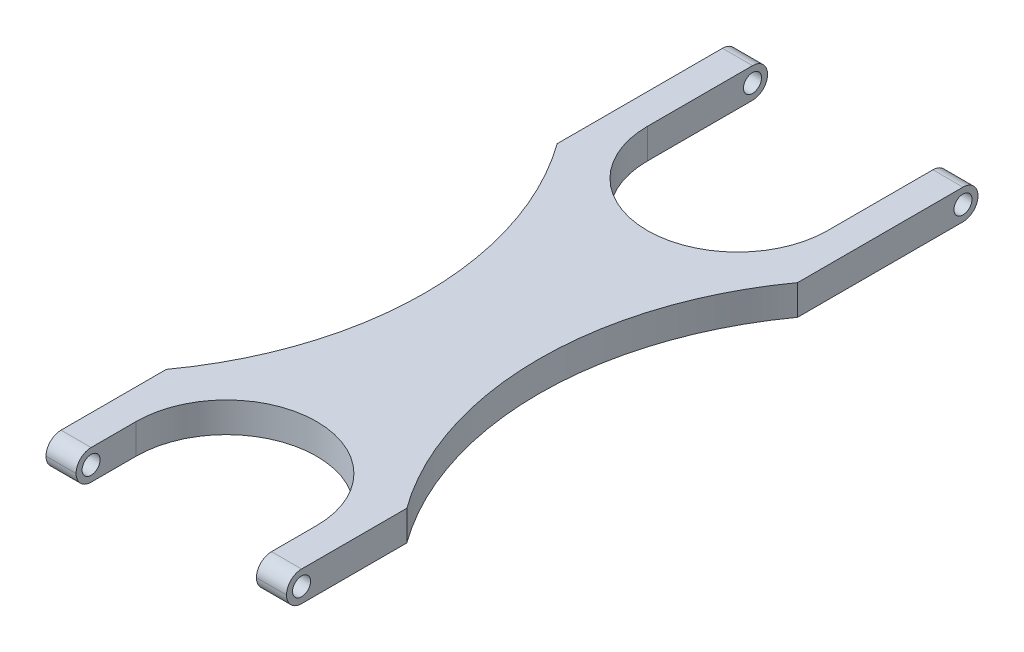
ISO-10303-21;
HEADER;
FILE_DESCRIPTION(('STEP AP214'),'2;1');
FILE_NAME('part.step','',(''),(''),'','','');
FILE_SCHEMA(('AUTOMOTIVE_DESIGN { 1 0 10303 214 1 1 1 1 }'));
ENDSEC;
DATA;
#1=APPLICATION_CONTEXT('core data for automotive mechanical design processes');
#2=APPLICATION_PROTOCOL_DEFINITION('international standard','automotive_design',2000,#1);
#3=PRODUCT_CONTEXT('',#1,'mechanical');
#4=PRODUCT('Part','Part','',(#3));
#5=PRODUCT_RELATED_PRODUCT_CATEGORY('part','',(#4));
#6=PRODUCT_DEFINITION_FORMATION('','',#4);
#7=PRODUCT_DEFINITION_CONTEXT('part definition',#1,'design');
#8=PRODUCT_DEFINITION('design','',#6,#7);
#9=PRODUCT_DEFINITION_SHAPE('','',#8);
#10=(LENGTH_UNIT() NAMED_UNIT(*) SI_UNIT(.MILLI.,.METRE.));
#11=(NAMED_UNIT(*) PLANE_ANGLE_UNIT() SI_UNIT($,.RADIAN.));
#12=(NAMED_UNIT(*) SI_UNIT($,.STERADIAN.) SOLID_ANGLE_UNIT());
#13=UNCERTAINTY_MEASURE_WITH_UNIT(LENGTH_MEASURE(1.E-05),#10,'distance_accuracy_value','');
#14=(GEOMETRIC_REPRESENTATION_CONTEXT(3) GLOBAL_UNCERTAINTY_ASSIGNED_CONTEXT((#13)) GLOBAL_UNIT_ASSIGNED_CONTEXT((#10,
#11,#12)) REPRESENTATION_CONTEXT('',''));
#15=CARTESIAN_POINT('',(0.,0.,0.));
#16=DIRECTION('',(0.,0.,1.));
#17=DIRECTION('',(1.,0.,0.));
#18=AXIS2_PLACEMENT_3D('',#15,#16,#17);
#19=CARTESIAN_POINT('',(0.,12.7,0.));
#20=DIRECTION('',(1.,0.,0.));
#21=DIRECTION('',(0.,0.,-1.));
#22=AXIS2_PLACEMENT_3D('',#19,#20,#21);
#23=PLANE('',#22);
#24=CARTESIAN_POINT('',(-1.11022302462516E-13,6.35,6.35000000000002));
#25=DIRECTION('',(1.,0.,0.));
#26=DIRECTION('',(0.,0.,-1.));
#27=AXIS2_PLACEMENT_3D('',#24,#25,#26);
#28=CIRCLE('',#27,3.81);
#29=CARTESIAN_POINT('',(-1.12410081243297E-13,6.35,2.54000000000002));
#30=VERTEX_POINT('',#29);
#31=EDGE_CURVE('E643',#30,#30,#28,.T.);
#32=ORIENTED_EDGE('',*,*,#31,.T.);
#33=EDGE_LOOP('',(#32));
#34=FACE_BOUND('',#33,.T.);
#35=CARTESIAN_POINT('',(0.,6.35,6.34999999999999));
#36=DIRECTION('',(1.,0.,0.));
#37=DIRECTION('',(0.,0.,-1.));
#38=AXIS2_PLACEMENT_3D('',#35,#36,#37);
#39=CIRCLE('',#38,6.35);
#40=CARTESIAN_POINT('',(0.,12.7,6.34999999999999));
#41=VERTEX_POINT('',#40);
#42=CARTESIAN_POINT('',(0.,6.35,0.));
#43=VERTEX_POINT('',#42);
#44=EDGE_CURVE('E221',#41,#43,#39,.F.);
#45=ORIENTED_EDGE('',*,*,#44,.T.);
#46=CARTESIAN_POINT('',(0.,6.35,6.35));
#47=DIRECTION('',(1.,0.,0.));
#48=DIRECTION('',(0.,0.,-1.));
#49=AXIS2_PLACEMENT_3D('',#46,#47,#48);
#50=CIRCLE('',#49,6.35);
#51=CARTESIAN_POINT('',(0.,0.,6.35));
#52=VERTEX_POINT('',#51);
#53=EDGE_CURVE('E223',#43,#52,#50,.F.);
#54=ORIENTED_EDGE('',*,*,#53,.T.);
#55=DIRECTION('',(0.,0.,1.));
#56=VECTOR('',#55,1.);
#57=CARTESIAN_POINT('',(0.,0.,0.));
#58=LINE('',#57,#56);
#59=CARTESIAN_POINT('',(0.,0.,76.2));
#60=VERTEX_POINT('',#59);
#61=EDGE_CURVE('E194',#52,#60,#58,.T.);
#62=ORIENTED_EDGE('',*,*,#61,.T.);
#63=DIRECTION('',(0.,-1.,0.));
#64=VECTOR('',#63,1.);
#65=CARTESIAN_POINT('',(0.,12.7,76.2));
#66=LINE('',#65,#64);
#67=CARTESIAN_POINT('',(0.,12.7,76.2));
#68=VERTEX_POINT('',#67);
#69=EDGE_CURVE('E187',#68,#60,#66,.T.);
#70=ORIENTED_EDGE('',*,*,#69,.F.);
#71=DIRECTION('',(0.,0.,1.));
#72=VECTOR('',#71,1.);
#73=CARTESIAN_POINT('',(0.,12.7,0.));
#74=LINE('',#73,#72);
#75=EDGE_CURVE('E169',#41,#68,#74,.T.);
#76=ORIENTED_EDGE('',*,*,#75,.F.);
#77=EDGE_LOOP('',(#45,#54,#62,#70,#76));
#78=FACE_BOUND('',#77,.T.);
#79=ADVANCED_FACE('F32',(#34,#78),#23,.F.);
#80=CARTESIAN_POINT('',(-114.3,12.7,158.75));
#81=DIRECTION('',(0.,-1.,0.));
#82=DIRECTION('',(0.,0.,-1.));
#83=AXIS2_PLACEMENT_3D('',#80,#81,#82);
#84=CYLINDRICAL_SURFACE('',#83,140.992881025958);
#85=CARTESIAN_POINT('',(-114.3,0.,158.75));
#86=DIRECTION('',(0.,-1.,0.));
#87=DIRECTION('',(0.,0.,-1.));
#88=AXIS2_PLACEMENT_3D('',#85,#86,#87);
#89=CIRCLE('',#88,140.992881025958);
#90=CARTESIAN_POINT('',(0.,0.,241.3));
#91=VERTEX_POINT('',#90);
#92=EDGE_CURVE('E293',#60,#91,#89,.T.);
#93=ORIENTED_EDGE('',*,*,#92,.T.);
#94=DIRECTION('',(0.,-1.,0.));
#95=VECTOR('',#94,1.);
#96=CARTESIAN_POINT('',(0.,12.7,241.3));
#97=LINE('',#96,#95);
#98=CARTESIAN_POINT('',(0.,12.7,241.3));
#99=VERTEX_POINT('',#98);
#100=EDGE_CURVE('E189',#99,#91,#97,.T.);
#101=ORIENTED_EDGE('',*,*,#100,.F.);
#102=CARTESIAN_POINT('',(-114.3,12.7,158.75));
#103=DIRECTION('',(0.,-1.,0.));
#104=DIRECTION('',(0.,0.,-1.));
#105=AXIS2_PLACEMENT_3D('',#102,#103,#104);
#106=CIRCLE('',#105,140.992881025958);
#107=EDGE_CURVE('E174',#68,#99,#106,.T.);
#108=ORIENTED_EDGE('',*,*,#107,.F.);
#109=ORIENTED_EDGE('',*,*,#69,.T.);
#110=EDGE_LOOP('',(#93,#101,#108,#109));
#111=FACE_BOUND('',#110,.T.);
#112=ADVANCED_FACE('F186',(#111),#84,.F.);
#113=CARTESIAN_POINT('',(0.,12.7,241.3));
#114=DIRECTION('',(1.,0.,0.));
#115=DIRECTION('',(0.,0.,-1.));
#116=AXIS2_PLACEMENT_3D('',#113,#114,#115);
#117=PLANE('',#116);
#118=CARTESIAN_POINT('',(0.,6.35,285.75));
#119=DIRECTION('',(1.,0.,0.));
#120=DIRECTION('',(0.,0.,-1.));
#121=AXIS2_PLACEMENT_3D('',#118,#119,#120);
#122=CIRCLE('',#121,3.81000000000004);
#123=CARTESIAN_POINT('',(0.,6.35,281.94));
#124=VERTEX_POINT('',#123);
#125=EDGE_CURVE('E267',#124,#124,#122,.T.);
#126=ORIENTED_EDGE('',*,*,#125,.T.);
#127=EDGE_LOOP('',(#126));
#128=FACE_BOUND('',#127,.T.);
#129=DIRECTION('',(0.,0.,1.));
#130=VECTOR('',#129,1.);
#131=CARTESIAN_POINT('',(0.,0.,241.3));
#132=LINE('',#131,#130);
#133=CARTESIAN_POINT('',(0.,0.,285.75));
#134=VERTEX_POINT('',#133);
#135=EDGE_CURVE('E295',#91,#134,#132,.T.);
#136=ORIENTED_EDGE('',*,*,#135,.T.);
#137=CARTESIAN_POINT('',(0.,6.35,285.75));
#138=DIRECTION('',(1.,0.,0.));
#139=DIRECTION('',(0.,0.,-1.));
#140=AXIS2_PLACEMENT_3D('',#137,#138,#139);
#141=CIRCLE('',#140,6.35);
#142=CARTESIAN_POINT('',(0.,6.35,292.1));
#143=VERTEX_POINT('',#142);
#144=EDGE_CURVE('E242',#134,#143,#141,.F.);
#145=ORIENTED_EDGE('',*,*,#144,.T.);
#146=CARTESIAN_POINT('',(0.,6.35,285.75));
#147=DIRECTION('',(1.,0.,0.));
#148=DIRECTION('',(0.,0.,-1.));
#149=AXIS2_PLACEMENT_3D('',#146,#147,#148);
#150=CIRCLE('',#149,6.35);
#151=CARTESIAN_POINT('',(0.,12.7,285.75));
#152=VERTEX_POINT('',#151);
#153=EDGE_CURVE('E240',#143,#152,#150,.F.);
#154=ORIENTED_EDGE('',*,*,#153,.T.);
#155=DIRECTION('',(0.,0.,1.));
#156=VECTOR('',#155,1.);
#157=CARTESIAN_POINT('',(0.,12.7,241.3));
#158=LINE('',#157,#156);
#159=EDGE_CURVE('E191',#99,#152,#158,.T.);
#160=ORIENTED_EDGE('',*,*,#159,.F.);
#161=ORIENTED_EDGE('',*,*,#100,.T.);
#162=EDGE_LOOP('',(#136,#145,#154,#160,#161));
#163=FACE_BOUND('',#162,.T.);
#164=ADVANCED_FACE('F396',(#128,#163),#117,.F.);
#165=CARTESIAN_POINT('',(12.7,12.7,292.1));
#166=DIRECTION('',(-1.,0.,0.));
#167=DIRECTION('',(0.,0.,1.));
#168=AXIS2_PLACEMENT_3D('',#165,#166,#167);
#169=PLANE('',#168);
#170=CARTESIAN_POINT('',(12.7,6.35,285.75));
#171=DIRECTION('',(-1.,0.,0.));
#172=DIRECTION('',(0.,0.,1.));
#173=AXIS2_PLACEMENT_3D('',#170,#171,#172);
#174=CIRCLE('',#173,3.81000000000004);
#175=CARTESIAN_POINT('',(12.7,6.35,281.94));
#176=VERTEX_POINT('',#175);
#177=EDGE_CURVE('E258',#176,#176,#174,.T.);
#178=ORIENTED_EDGE('',*,*,#177,.T.);
#179=EDGE_LOOP('',(#178));
#180=FACE_BOUND('',#179,.T.);
#181=CARTESIAN_POINT('',(12.7,6.35,285.75));
#182=DIRECTION('',(-1.,0.,0.));
#183=DIRECTION('',(0.,0.,1.));
#184=AXIS2_PLACEMENT_3D('',#181,#182,#183);
#185=CIRCLE('',#184,6.35);
#186=CARTESIAN_POINT('',(12.7,12.7,285.75));
#187=VERTEX_POINT('',#186);
#188=CARTESIAN_POINT('',(12.7,6.35,292.1));
#189=VERTEX_POINT('',#188);
#190=EDGE_CURVE('E236',#187,#189,#185,.F.);
#191=ORIENTED_EDGE('',*,*,#190,.T.);
#192=CARTESIAN_POINT('',(12.7,6.35,285.75));
#193=DIRECTION('',(-1.,0.,0.));
#194=DIRECTION('',(0.,0.,1.));
#195=AXIS2_PLACEMENT_3D('',#192,#193,#194);
#196=CIRCLE('',#195,6.35);
#197=CARTESIAN_POINT('',(12.7,0.,285.75));
#198=VERTEX_POINT('',#197);
#199=EDGE_CURVE('E238',#189,#198,#196,.F.);
#200=ORIENTED_EDGE('',*,*,#199,.T.);
#201=DIRECTION('',(0.,0.,-1.));
#202=VECTOR('',#201,1.);
#203=CARTESIAN_POINT('',(12.7,0.,292.1));
#204=LINE('',#203,#202);
#205=CARTESIAN_POINT('',(12.7,0.,266.7));
#206=VERTEX_POINT('',#205);
#207=EDGE_CURVE('E298',#198,#206,#204,.T.);
#208=ORIENTED_EDGE('',*,*,#207,.T.);
#209=DIRECTION('',(0.,-1.,0.));
#210=VECTOR('',#209,1.);
#211=CARTESIAN_POINT('',(12.7,12.7,266.7));
#212=LINE('',#211,#210);
#213=CARTESIAN_POINT('',(12.7,12.7,266.7));
#214=VERTEX_POINT('',#213);
#215=EDGE_CURVE('E200',#214,#206,#212,.T.);
#216=ORIENTED_EDGE('',*,*,#215,.F.);
#217=DIRECTION('',(0.,0.,-1.));
#218=VECTOR('',#217,1.);
#219=CARTESIAN_POINT('',(12.7,12.7,292.1));
#220=LINE('',#219,#218);
#221=EDGE_CURVE('E272',#187,#214,#220,.T.);
#222=ORIENTED_EDGE('',*,*,#221,.F.);
#223=EDGE_LOOP('',(#191,#200,#208,#216,#222));
#224=FACE_BOUND('',#223,.T.);
#225=ADVANCED_FACE('F339',(#180,#224),#169,.F.);
#226=CARTESIAN_POINT('',(50.8,12.7,266.7));
#227=DIRECTION('',(0.,-1.,0.));
#228=DIRECTION('',(0.,0.,-1.));
#229=AXIS2_PLACEMENT_3D('',#226,#227,#228);
#230=CYLINDRICAL_SURFACE('',#229,38.1);
#231=CARTESIAN_POINT('',(50.8,0.,266.7));
#232=DIRECTION('',(0.,-1.,0.));
#233=DIRECTION('',(0.,0.,1.));
#234=AXIS2_PLACEMENT_3D('',#231,#232,#233);
#235=CIRCLE('',#234,38.1);
#236=CARTESIAN_POINT('',(88.9,0.,266.7));
#237=VERTEX_POINT('',#236);
#238=EDGE_CURVE('E300',#206,#237,#235,.T.);
#239=ORIENTED_EDGE('',*,*,#238,.T.);
#240=DIRECTION('',(0.,-1.,0.));
#241=VECTOR('',#240,1.);
#242=CARTESIAN_POINT('',(88.9,12.7,266.7));
#243=LINE('',#242,#241);
#244=CARTESIAN_POINT('',(88.9,12.7,266.7));
#245=VERTEX_POINT('',#244);
#246=EDGE_CURVE('E328',#245,#237,#243,.T.);
#247=ORIENTED_EDGE('',*,*,#246,.F.);
#248=CARTESIAN_POINT('',(50.8,12.7,266.7));
#249=DIRECTION('',(0.,-1.,0.));
#250=DIRECTION('',(0.,0.,-1.));
#251=AXIS2_PLACEMENT_3D('',#248,#249,#250);
#252=CIRCLE('',#251,38.1);
#253=EDGE_CURVE('E274',#214,#245,#252,.T.);
#254=ORIENTED_EDGE('',*,*,#253,.F.);
#255=ORIENTED_EDGE('',*,*,#215,.T.);
#256=EDGE_LOOP('',(#239,#247,#254,#255));
#257=FACE_BOUND('',#256,.T.);
#258=ADVANCED_FACE('F334',(#257),#230,.F.);
#259=CARTESIAN_POINT('',(88.9000000000001,12.7,292.1));
#260=DIRECTION('',(1.,0.,0.));
#261=DIRECTION('',(0.,0.,-1.));
#262=AXIS2_PLACEMENT_3D('',#259,#260,#261);
#263=PLANE('',#262);
#264=CARTESIAN_POINT('',(88.9,6.35,285.75));
#265=DIRECTION('',(1.,0.,0.));
#266=DIRECTION('',(0.,0.,-1.));
#267=AXIS2_PLACEMENT_3D('',#264,#265,#266);
#268=CIRCLE('',#267,3.81000000000004);
#269=CARTESIAN_POINT('',(88.9,6.35,281.94));
#270=VERTEX_POINT('',#269);
#271=EDGE_CURVE('E262',#270,#270,#268,.T.);
#272=ORIENTED_EDGE('',*,*,#271,.T.);
#273=EDGE_LOOP('',(#272));
#274=FACE_BOUND('',#273,.T.);
#275=DIRECTION('',(0.,0.,1.));
#276=VECTOR('',#275,1.);
#277=CARTESIAN_POINT('',(88.9000000000001,0.,292.1));
#278=LINE('',#277,#276);
#279=CARTESIAN_POINT('',(88.9,0.,285.75));
#280=VERTEX_POINT('',#279);
#281=EDGE_CURVE('E302',#237,#280,#278,.T.);
#282=ORIENTED_EDGE('',*,*,#281,.T.);
#283=CARTESIAN_POINT('',(88.9000000000001,6.35,285.75));
#284=DIRECTION('',(1.,0.,0.));
#285=DIRECTION('',(0.,0.,-1.));
#286=AXIS2_PLACEMENT_3D('',#283,#284,#285);
#287=CIRCLE('',#286,6.35);
#288=CARTESIAN_POINT('',(88.9000000000001,6.35,292.1));
#289=VERTEX_POINT('',#288);
#290=EDGE_CURVE('E11',#280,#289,#287,.F.);
#291=ORIENTED_EDGE('',*,*,#290,.T.);
#292=CARTESIAN_POINT('',(88.9000000000001,6.35,285.75));
#293=DIRECTION('',(1.,0.,0.));
#294=DIRECTION('',(0.,0.,-1.));
#295=AXIS2_PLACEMENT_3D('',#292,#293,#294);
#296=CIRCLE('',#295,6.35);
#297=CARTESIAN_POINT('',(88.9,12.7,285.75));
#298=VERTEX_POINT('',#297);
#299=EDGE_CURVE('E41',#289,#298,#296,.F.);
#300=ORIENTED_EDGE('',*,*,#299,.T.);
#301=DIRECTION('',(0.,0.,1.));
#302=VECTOR('',#301,1.);
#303=CARTESIAN_POINT('',(88.9000000000001,12.7,292.1));
#304=LINE('',#303,#302);
#305=EDGE_CURVE('E276',#245,#298,#304,.T.);
#306=ORIENTED_EDGE('',*,*,#305,.F.);
#307=ORIENTED_EDGE('',*,*,#246,.T.);
#308=EDGE_LOOP('',(#282,#291,#300,#306,#307));
#309=FACE_BOUND('',#308,.T.);
#310=ADVANCED_FACE('F350',(#274,#309),#263,.F.);
#311=CARTESIAN_POINT('',(101.6,12.7,241.3));
#312=DIRECTION('',(-1.,0.,0.));
#313=DIRECTION('',(0.,0.,1.));
#314=AXIS2_PLACEMENT_3D('',#311,#312,#313);
#315=PLANE('',#314);
#316=CARTESIAN_POINT('',(101.6,6.35,285.75));
#317=DIRECTION('',(1.,0.,0.));
#318=DIRECTION('',(0.,0.,-1.));
#319=AXIS2_PLACEMENT_3D('',#316,#317,#318);
#320=CIRCLE('',#319,3.81000000000004);
#321=CARTESIAN_POINT('',(101.6,6.35,281.94));
#322=VERTEX_POINT('',#321);
#323=EDGE_CURVE('E639',#322,#322,#320,.T.);
#324=ORIENTED_EDGE('',*,*,#323,.F.);
#325=EDGE_LOOP('',(#324));
#326=FACE_BOUND('',#325,.T.);
#327=CARTESIAN_POINT('',(101.6,6.35,285.75));
#328=DIRECTION('',(-1.,0.,0.));
#329=DIRECTION('',(0.,0.,1.));
#330=AXIS2_PLACEMENT_3D('',#327,#328,#329);
#331=CIRCLE('',#330,6.35);
#332=CARTESIAN_POINT('',(101.6,12.7,285.75));
#333=VERTEX_POINT('',#332);
#334=CARTESIAN_POINT('',(101.6,6.35,292.1));
#335=VERTEX_POINT('',#334);
#336=EDGE_CURVE('E55',#333,#335,#331,.F.);
#337=ORIENTED_EDGE('',*,*,#336,.T.);
#338=CARTESIAN_POINT('',(101.6,6.35,285.75));
#339=DIRECTION('',(-1.,0.,0.));
#340=DIRECTION('',(0.,0.,1.));
#341=AXIS2_PLACEMENT_3D('',#338,#339,#340);
#342=CIRCLE('',#341,6.35);
#343=CARTESIAN_POINT('',(101.6,0.,285.75));
#344=VERTEX_POINT('',#343);
#345=EDGE_CURVE('E245',#335,#344,#342,.F.);
#346=ORIENTED_EDGE('',*,*,#345,.T.);
#347=DIRECTION('',(0.,0.,-1.));
#348=VECTOR('',#347,1.);
#349=CARTESIAN_POINT('',(101.6,0.,241.3));
#350=LINE('',#349,#348);
#351=CARTESIAN_POINT('',(101.6,0.,241.3));
#352=VERTEX_POINT('',#351);
#353=EDGE_CURVE('E304',#344,#352,#350,.T.);
#354=ORIENTED_EDGE('',*,*,#353,.T.);
#355=DIRECTION('',(0.,-1.,0.));
#356=VECTOR('',#355,1.);
#357=CARTESIAN_POINT('',(101.6,12.7,241.3));
#358=LINE('',#357,#356);
#359=CARTESIAN_POINT('',(101.6,12.7,241.3));
#360=VERTEX_POINT('',#359);
#361=EDGE_CURVE('E325',#360,#352,#358,.T.);
#362=ORIENTED_EDGE('',*,*,#361,.F.);
#363=DIRECTION('',(0.,0.,-1.));
#364=VECTOR('',#363,1.);
#365=CARTESIAN_POINT('',(101.6,12.7,241.3));
#366=LINE('',#365,#364);
#367=EDGE_CURVE('E279',#333,#360,#366,.T.);
#368=ORIENTED_EDGE('',*,*,#367,.F.);
#369=EDGE_LOOP('',(#337,#346,#354,#362,#368));
#370=FACE_BOUND('',#369,.T.);
#371=ADVANCED_FACE('F355',(#326,#370),#315,.F.);
#372=CARTESIAN_POINT('',(215.9,12.7,158.75));
#373=DIRECTION('',(0.,-1.,0.));
#374=DIRECTION('',(0.,0.,-1.));
#375=AXIS2_PLACEMENT_3D('',#372,#373,#374);
#376=CYLINDRICAL_SURFACE('',#375,140.992881025958);
#377=CARTESIAN_POINT('',(215.9,0.,158.75));
#378=DIRECTION('',(0.,-1.,0.));
#379=DIRECTION('',(0.,0.,1.));
#380=AXIS2_PLACEMENT_3D('',#377,#378,#379);
#381=CIRCLE('',#380,140.992881025958);
#382=CARTESIAN_POINT('',(101.6,0.,76.2));
#383=VERTEX_POINT('',#382);
#384=EDGE_CURVE('E306',#352,#383,#381,.T.);
#385=ORIENTED_EDGE('',*,*,#384,.T.);
#386=DIRECTION('',(0.,-1.,0.));
#387=VECTOR('',#386,1.);
#388=CARTESIAN_POINT('',(101.6,12.7,76.2));
#389=LINE('',#388,#387);
#390=CARTESIAN_POINT('',(101.6,12.7,76.2));
#391=VERTEX_POINT('',#390);
#392=EDGE_CURVE('E322',#391,#383,#389,.T.);
#393=ORIENTED_EDGE('',*,*,#392,.F.);
#394=CARTESIAN_POINT('',(215.9,12.7,158.75));
#395=DIRECTION('',(0.,-1.,0.));
#396=DIRECTION('',(0.,0.,1.));
#397=AXIS2_PLACEMENT_3D('',#394,#395,#396);
#398=CIRCLE('',#397,140.992881025958);
#399=EDGE_CURVE('E281',#360,#391,#398,.T.);
#400=ORIENTED_EDGE('',*,*,#399,.F.);
#401=ORIENTED_EDGE('',*,*,#361,.T.);
#402=EDGE_LOOP('',(#385,#393,#400,#401));
#403=FACE_BOUND('',#402,.T.);
#404=ADVANCED_FACE('F361',(#403),#376,.F.);
#405=CARTESIAN_POINT('',(101.6,12.7,0.));
#406=DIRECTION('',(-1.,0.,0.));
#407=DIRECTION('',(0.,0.,1.));
#408=AXIS2_PLACEMENT_3D('',#405,#406,#407);
#409=PLANE('',#408);
#410=CARTESIAN_POINT('',(101.6,6.35,6.34999999999999));
#411=DIRECTION('',(1.,0.,0.));
#412=DIRECTION('',(0.,0.,-1.));
#413=AXIS2_PLACEMENT_3D('',#410,#411,#412);
#414=CIRCLE('',#413,3.81);
#415=CARTESIAN_POINT('',(101.6,6.35,2.53999999999999));
#416=VERTEX_POINT('',#415);
#417=EDGE_CURVE('E635',#416,#416,#414,.T.);
#418=ORIENTED_EDGE('',*,*,#417,.F.);
#419=EDGE_LOOP('',(#418));
#420=FACE_BOUND('',#419,.T.);
#421=DIRECTION('',(0.,0.,-1.));
#422=VECTOR('',#421,1.);
#423=CARTESIAN_POINT('',(101.6,0.,0.));
#424=LINE('',#423,#422);
#425=CARTESIAN_POINT('',(101.6,0.,6.34999999999999));
#426=VERTEX_POINT('',#425);
#427=EDGE_CURVE('E308',#383,#426,#424,.T.);
#428=ORIENTED_EDGE('',*,*,#427,.T.);
#429=CARTESIAN_POINT('',(101.6,6.35,6.34999999999999));
#430=DIRECTION('',(-1.,0.,0.));
#431=DIRECTION('',(0.,0.,1.));
#432=AXIS2_PLACEMENT_3D('',#429,#430,#431);
#433=CIRCLE('',#432,6.35);
#434=CARTESIAN_POINT('',(101.6,6.35,0.));
#435=VERTEX_POINT('',#434);
#436=EDGE_CURVE('E219',#426,#435,#433,.F.);
#437=ORIENTED_EDGE('',*,*,#436,.T.);
#438=CARTESIAN_POINT('',(101.6,6.35,6.34999999999999));
#439=DIRECTION('',(-1.,0.,0.));
#440=DIRECTION('',(0.,0.,1.));
#441=AXIS2_PLACEMENT_3D('',#438,#439,#440);
#442=CIRCLE('',#441,6.35);
#443=CARTESIAN_POINT('',(101.6,12.7,6.34999999999999));
#444=VERTEX_POINT('',#443);
#445=EDGE_CURVE('E217',#435,#444,#442,.F.);
#446=ORIENTED_EDGE('',*,*,#445,.T.);
#447=DIRECTION('',(0.,0.,-1.));
#448=VECTOR('',#447,1.);
#449=CARTESIAN_POINT('',(101.6,12.7,0.));
#450=LINE('',#449,#448);
#451=EDGE_CURVE('E283',#391,#444,#450,.T.);
#452=ORIENTED_EDGE('',*,*,#451,.F.);
#453=ORIENTED_EDGE('',*,*,#392,.T.);
#454=EDGE_LOOP('',(#428,#437,#446,#452,#453));
#455=FACE_BOUND('',#454,.T.);
#456=ADVANCED_FACE('F365',(#420,#455),#409,.F.);
#457=CARTESIAN_POINT('',(88.9,12.7,0.));
#458=DIRECTION('',(1.,0.,0.));
#459=DIRECTION('',(0.,0.,-1.));
#460=AXIS2_PLACEMENT_3D('',#457,#458,#459);
#461=PLANE('',#460);
#462=CARTESIAN_POINT('',(88.9,6.35,6.34999999999999));
#463=DIRECTION('',(1.,0.,0.));
#464=DIRECTION('',(0.,0.,-1.));
#465=AXIS2_PLACEMENT_3D('',#462,#463,#464);
#466=CIRCLE('',#465,3.81);
#467=CARTESIAN_POINT('',(88.9,6.35,2.53999999999999));
#468=VERTEX_POINT('',#467);
#469=EDGE_CURVE('E638',#468,#468,#466,.T.);
#470=ORIENTED_EDGE('',*,*,#469,.T.);
#471=EDGE_LOOP('',(#470));
#472=FACE_BOUND('',#471,.T.);
#473=CARTESIAN_POINT('',(88.9,6.35,6.34999999999999));
#474=DIRECTION('',(1.,0.,0.));
#475=DIRECTION('',(0.,0.,-1.));
#476=AXIS2_PLACEMENT_3D('',#473,#474,#475);
#477=CIRCLE('',#476,6.35);
#478=CARTESIAN_POINT('',(88.9,12.7,6.34999999999999));
#479=VERTEX_POINT('',#478);
#480=CARTESIAN_POINT('',(88.9,6.35,0.));
#481=VERTEX_POINT('',#480);
#482=EDGE_CURVE('E196',#479,#481,#477,.F.);
#483=ORIENTED_EDGE('',*,*,#482,.T.);
#484=CARTESIAN_POINT('',(88.9,6.35,6.34999999999999));
#485=DIRECTION('',(1.,0.,0.));
#486=DIRECTION('',(0.,0.,-1.));
#487=AXIS2_PLACEMENT_3D('',#484,#485,#486);
#488=CIRCLE('',#487,6.35);
#489=CARTESIAN_POINT('',(88.9,0.,6.34999999999999));
#490=VERTEX_POINT('',#489);
#491=EDGE_CURVE('E198',#481,#490,#488,.F.);
#492=ORIENTED_EDGE('',*,*,#491,.T.);
#493=DIRECTION('',(0.,0.,1.));
#494=VECTOR('',#493,1.);
#495=CARTESIAN_POINT('',(88.9,0.,0.));
#496=LINE('',#495,#494);
#497=CARTESIAN_POINT('',(88.9,0.,50.8));
#498=VERTEX_POINT('',#497);
#499=EDGE_CURVE('E311',#490,#498,#496,.T.);
#500=ORIENTED_EDGE('',*,*,#499,.T.);
#501=DIRECTION('',(0.,-1.,0.));
#502=VECTOR('',#501,1.);
#503=CARTESIAN_POINT('',(88.9,12.7,50.8));
#504=LINE('',#503,#502);
#505=CARTESIAN_POINT('',(88.9,12.7,50.8));
#506=VERTEX_POINT('',#505);
#507=EDGE_CURVE('E319',#506,#498,#504,.T.);
#508=ORIENTED_EDGE('',*,*,#507,.F.);
#509=DIRECTION('',(0.,0.,1.));
#510=VECTOR('',#509,1.);
#511=CARTESIAN_POINT('',(88.9,12.7,0.));
#512=LINE('',#511,#510);
#513=EDGE_CURVE('E285',#479,#506,#512,.T.);
#514=ORIENTED_EDGE('',*,*,#513,.F.);
#515=EDGE_LOOP('',(#483,#492,#500,#508,#514));
#516=FACE_BOUND('',#515,.T.);
#517=ADVANCED_FACE('F375',(#472,#516),#461,.F.);
#518=CARTESIAN_POINT('',(50.8,12.7,50.8));
#519=DIRECTION('',(0.,-1.,0.));
#520=DIRECTION('',(0.,0.,-1.));
#521=AXIS2_PLACEMENT_3D('',#518,#519,#520);
#522=CYLINDRICAL_SURFACE('',#521,38.1);
#523=CARTESIAN_POINT('',(50.8,0.,50.8));
#524=DIRECTION('',(0.,-1.,0.));
#525=DIRECTION('',(0.,0.,1.));
#526=AXIS2_PLACEMENT_3D('',#523,#524,#525);
#527=CIRCLE('',#526,38.1);
#528=CARTESIAN_POINT('',(12.7,0.,50.8));
#529=VERTEX_POINT('',#528);
#530=EDGE_CURVE('E313',#498,#529,#527,.T.);
#531=ORIENTED_EDGE('',*,*,#530,.T.);
#532=DIRECTION('',(0.,-1.,0.));
#533=VECTOR('',#532,1.);
#534=CARTESIAN_POINT('',(12.7,12.7,50.8));
#535=LINE('',#534,#533);
#536=CARTESIAN_POINT('',(12.7,12.7,50.8));
#537=VERTEX_POINT('',#536);
#538=EDGE_CURVE('E291',#537,#529,#535,.T.);
#539=ORIENTED_EDGE('',*,*,#538,.F.);
#540=CARTESIAN_POINT('',(50.8,12.7,50.8));
#541=DIRECTION('',(0.,-1.,0.));
#542=DIRECTION('',(0.,0.,-1.));
#543=AXIS2_PLACEMENT_3D('',#540,#541,#542);
#544=CIRCLE('',#543,38.1);
#545=EDGE_CURVE('E287',#506,#537,#544,.T.);
#546=ORIENTED_EDGE('',*,*,#545,.F.);
#547=ORIENTED_EDGE('',*,*,#507,.T.);
#548=EDGE_LOOP('',(#531,#539,#546,#547));
#549=FACE_BOUND('',#548,.T.);
#550=ADVANCED_FACE('F381',(#549),#522,.F.);
#551=CARTESIAN_POINT('',(12.7,12.7,0.));
#552=DIRECTION('',(-1.,0.,0.));
#553=DIRECTION('',(0.,0.,1.));
#554=AXIS2_PLACEMENT_3D('',#551,#552,#553);
#555=PLANE('',#554);
#556=CARTESIAN_POINT('',(12.7,6.35,6.35000000000002));
#557=DIRECTION('',(-1.,0.,0.));
#558=DIRECTION('',(0.,0.,1.));
#559=AXIS2_PLACEMENT_3D('',#556,#557,#558);
#560=CIRCLE('',#559,3.81);
#561=CARTESIAN_POINT('',(12.7,6.35,10.16));
#562=VERTEX_POINT('',#561);
#563=EDGE_CURVE('E36',#562,#562,#560,.T.);
#564=ORIENTED_EDGE('',*,*,#563,.T.);
#565=EDGE_LOOP('',(#564));
#566=FACE_BOUND('',#565,.T.);
#567=DIRECTION('',(0.,0.,-1.));
#568=VECTOR('',#567,1.);
#569=CARTESIAN_POINT('',(12.7,0.,0.));
#570=LINE('',#569,#568);
#571=CARTESIAN_POINT('',(12.7,0.,6.35));
#572=VERTEX_POINT('',#571);
#573=EDGE_CURVE('E182',#529,#572,#570,.T.);
#574=ORIENTED_EDGE('',*,*,#573,.T.);
#575=CARTESIAN_POINT('',(12.7,6.35,6.35));
#576=DIRECTION('',(-1.,0.,0.));
#577=DIRECTION('',(0.,0.,1.));
#578=AXIS2_PLACEMENT_3D('',#575,#576,#577);
#579=CIRCLE('',#578,6.35);
#580=CARTESIAN_POINT('',(12.7,6.35,0.));
#581=VERTEX_POINT('',#580);
#582=EDGE_CURVE('E227',#572,#581,#579,.F.);
#583=ORIENTED_EDGE('',*,*,#582,.T.);
#584=CARTESIAN_POINT('',(12.7,6.35,6.34999999999999));
#585=DIRECTION('',(-1.,0.,0.));
#586=DIRECTION('',(0.,0.,1.));
#587=AXIS2_PLACEMENT_3D('',#584,#585,#586);
#588=CIRCLE('',#587,6.35);
#589=CARTESIAN_POINT('',(12.7,12.7,6.34999999999999));
#590=VERTEX_POINT('',#589);
#591=EDGE_CURVE('E225',#581,#590,#588,.F.);
#592=ORIENTED_EDGE('',*,*,#591,.T.);
#593=DIRECTION('',(0.,0.,-1.));
#594=VECTOR('',#593,1.);
#595=CARTESIAN_POINT('',(12.7,12.7,0.));
#596=LINE('',#595,#594);
#597=EDGE_CURVE('E289',#537,#590,#596,.T.);
#598=ORIENTED_EDGE('',*,*,#597,.F.);
#599=ORIENTED_EDGE('',*,*,#538,.T.);
#600=EDGE_LOOP('',(#574,#583,#592,#598,#599));
#601=FACE_BOUND('',#600,.T.);
#602=ADVANCED_FACE('F385',(#566,#601),#555,.F.);
#603=CARTESIAN_POINT('',(-114.3,12.7,158.75));
#604=DIRECTION('',(0.,-1.,0.));
#605=DIRECTION('',(0.,0.,-1.));
#606=AXIS2_PLACEMENT_3D('',#603,#604,#605);
#607=PLANE('',#606);
#608=ORIENTED_EDGE('',*,*,#451,.T.);
#609=DIRECTION('',(-1.,0.,0.));
#610=VECTOR('',#609,1.);
#611=CARTESIAN_POINT('',(-114.3,12.7,6.35000000000005));
#612=LINE('',#611,#610);
#613=EDGE_CURVE('E234',#444,#479,#612,.T.);
#614=ORIENTED_EDGE('',*,*,#613,.T.);
#615=ORIENTED_EDGE('',*,*,#513,.T.);
#616=ORIENTED_EDGE('',*,*,#545,.T.);
#617=ORIENTED_EDGE('',*,*,#597,.T.);
#618=DIRECTION('',(-1.,0.,0.));
#619=VECTOR('',#618,1.);
#620=CARTESIAN_POINT('',(-114.3,12.7,6.34999999999999));
#621=LINE('',#620,#619);
#622=EDGE_CURVE('E178',#590,#41,#621,.T.);
#623=ORIENTED_EDGE('',*,*,#622,.T.);
#624=ORIENTED_EDGE('',*,*,#75,.T.);
#625=ORIENTED_EDGE('',*,*,#107,.T.);
#626=ORIENTED_EDGE('',*,*,#159,.T.);
#627=DIRECTION('',(1.,0.,0.));
#628=VECTOR('',#627,1.);
#629=CARTESIAN_POINT('',(-114.3,12.7,285.75));
#630=LINE('',#629,#628);
#631=EDGE_CURVE('E231',#152,#187,#630,.T.);
#632=ORIENTED_EDGE('',*,*,#631,.T.);
#633=ORIENTED_EDGE('',*,*,#221,.T.);
#634=ORIENTED_EDGE('',*,*,#253,.T.);
#635=ORIENTED_EDGE('',*,*,#305,.T.);
#636=DIRECTION('',(1.,0.,0.));
#637=VECTOR('',#636,1.);
#638=CARTESIAN_POINT('',(-114.3,12.7,285.75));
#639=LINE('',#638,#637);
#640=EDGE_CURVE('E229',#298,#333,#639,.T.);
#641=ORIENTED_EDGE('',*,*,#640,.T.);
#642=ORIENTED_EDGE('',*,*,#367,.T.);
#643=ORIENTED_EDGE('',*,*,#399,.T.);
#644=EDGE_LOOP('',(#608,#614,#615,#616,#617,#623,#624,#625,#626,#632,#633,#634,#635,#641,#642,#643));
#645=FACE_BOUND('',#644,.T.);
#646=ADVANCED_FACE('F172',(#645),#607,.F.);
#647=CARTESIAN_POINT('',(-114.3,0.,158.75));
#648=DIRECTION('',(0.,-1.,0.));
#649=DIRECTION('',(0.,0.,-1.));
#650=AXIS2_PLACEMENT_3D('',#647,#648,#649);
#651=PLANE('',#650);
#652=ORIENTED_EDGE('',*,*,#499,.F.);
#653=DIRECTION('',(-1.,0.,0.));
#654=VECTOR('',#653,1.);
#655=CARTESIAN_POINT('',(101.6,0.,6.34999999999999));
#656=LINE('',#655,#654);
#657=EDGE_CURVE('E214',#490,#426,#656,.F.);
#658=ORIENTED_EDGE('',*,*,#657,.T.);
#659=ORIENTED_EDGE('',*,*,#427,.F.);
#660=ORIENTED_EDGE('',*,*,#384,.F.);
#661=ORIENTED_EDGE('',*,*,#353,.F.);
#662=DIRECTION('',(1.,0.,0.));
#663=VECTOR('',#662,1.);
#664=CARTESIAN_POINT('',(88.9000000000001,0.,285.75));
#665=LINE('',#664,#663);
#666=EDGE_CURVE('E205',#344,#280,#665,.F.);
#667=ORIENTED_EDGE('',*,*,#666,.T.);
#668=ORIENTED_EDGE('',*,*,#281,.F.);
#669=ORIENTED_EDGE('',*,*,#238,.F.);
#670=ORIENTED_EDGE('',*,*,#207,.F.);
#671=DIRECTION('',(1.,0.,0.));
#672=VECTOR('',#671,1.);
#673=CARTESIAN_POINT('',(0.,0.,285.75));
#674=LINE('',#673,#672);
#675=EDGE_CURVE('E208',#198,#134,#674,.F.);
#676=ORIENTED_EDGE('',*,*,#675,.T.);
#677=ORIENTED_EDGE('',*,*,#135,.F.);
#678=ORIENTED_EDGE('',*,*,#92,.F.);
#679=ORIENTED_EDGE('',*,*,#61,.F.);
#680=DIRECTION('',(-1.,0.,0.));
#681=VECTOR('',#680,1.);
#682=CARTESIAN_POINT('',(12.7,0.,6.35));
#683=LINE('',#682,#681);
#684=EDGE_CURVE('E211',#52,#572,#683,.F.);
#685=ORIENTED_EDGE('',*,*,#684,.T.);
#686=ORIENTED_EDGE('',*,*,#573,.F.);
#687=ORIENTED_EDGE('',*,*,#530,.F.);
#688=EDGE_LOOP('',(#652,#658,#659,#660,#661,#667,#668,#669,#670,#676,#677,#678,#679,#685,#686,#687));
#689=FACE_BOUND('',#688,.T.);
#690=ADVANCED_FACE('F347',(#689),#651,.T.);
#691=CARTESIAN_POINT('',(-114.3,6.35,6.35000000000005));
#692=DIRECTION('',(-1.,0.,0.));
#693=DIRECTION('',(0.,0.,1.));
#694=AXIS2_PLACEMENT_3D('',#691,#692,#693);
#695=CYLINDRICAL_SURFACE('',#694,6.35);
#696=ORIENTED_EDGE('',*,*,#613,.F.);
#697=ORIENTED_EDGE('',*,*,#445,.F.);
#698=DIRECTION('',(-1.,0.,0.));
#699=VECTOR('',#698,1.);
#700=CARTESIAN_POINT('',(101.6,6.35,0.));
#701=LINE('',#700,#699);
#702=EDGE_CURVE('E248',#481,#435,#701,.F.);
#703=ORIENTED_EDGE('',*,*,#702,.F.);
#704=ORIENTED_EDGE('',*,*,#482,.F.);
#705=EDGE_LOOP('',(#696,#697,#703,#704));
#706=FACE_BOUND('',#705,.T.);
#707=ADVANCED_FACE('F371',(#706),#695,.T.);
#708=CARTESIAN_POINT('',(101.6,6.35,6.34999999999999));
#709=DIRECTION('',(1.,0.,0.));
#710=DIRECTION('',(0.,0.,-1.));
#711=AXIS2_PLACEMENT_3D('',#708,#709,#710);
#712=CYLINDRICAL_SURFACE('',#711,6.35);
#713=ORIENTED_EDGE('',*,*,#436,.F.);
#714=ORIENTED_EDGE('',*,*,#657,.F.);
#715=ORIENTED_EDGE('',*,*,#491,.F.);
#716=ORIENTED_EDGE('',*,*,#702,.T.);
#717=EDGE_LOOP('',(#713,#714,#715,#716));
#718=FACE_BOUND('',#717,.T.);
#719=ADVANCED_FACE('F422',(#718),#712,.T.);
#720=CARTESIAN_POINT('',(-114.3,6.35,6.34999999999999));
#721=DIRECTION('',(-1.,0.,0.));
#722=DIRECTION('',(0.,0.,1.));
#723=AXIS2_PLACEMENT_3D('',#720,#721,#722);
#724=CYLINDRICAL_SURFACE('',#723,6.35);
#725=ORIENTED_EDGE('',*,*,#622,.F.);
#726=ORIENTED_EDGE('',*,*,#591,.F.);
#727=DIRECTION('',(-1.,0.,0.));
#728=VECTOR('',#727,1.);
#729=CARTESIAN_POINT('',(0.,6.35,0.));
#730=LINE('',#729,#728);
#731=EDGE_CURVE('E251',#43,#581,#730,.F.);
#732=ORIENTED_EDGE('',*,*,#731,.F.);
#733=ORIENTED_EDGE('',*,*,#44,.F.);
#734=EDGE_LOOP('',(#725,#726,#732,#733));
#735=FACE_BOUND('',#734,.T.);
#736=ADVANCED_FACE('F389',(#735),#724,.T.);
#737=CARTESIAN_POINT('',(0.,6.35,6.35));
#738=DIRECTION('',(1.,0.,0.));
#739=DIRECTION('',(0.,0.,-1.));
#740=AXIS2_PLACEMENT_3D('',#737,#738,#739);
#741=CYLINDRICAL_SURFACE('',#740,6.35);
#742=ORIENTED_EDGE('',*,*,#582,.F.);
#743=ORIENTED_EDGE('',*,*,#684,.F.);
#744=ORIENTED_EDGE('',*,*,#53,.F.);
#745=ORIENTED_EDGE('',*,*,#731,.T.);
#746=EDGE_LOOP('',(#742,#743,#744,#745));
#747=FACE_BOUND('',#746,.T.);
#748=ADVANCED_FACE('F392',(#747),#741,.T.);
#749=CARTESIAN_POINT('',(-114.3,6.35,285.75));
#750=DIRECTION('',(1.,0.,0.));
#751=DIRECTION('',(0.,0.,-1.));
#752=AXIS2_PLACEMENT_3D('',#749,#750,#751);
#753=CYLINDRICAL_SURFACE('',#752,6.35);
#754=ORIENTED_EDGE('',*,*,#631,.F.);
#755=ORIENTED_EDGE('',*,*,#153,.F.);
#756=DIRECTION('',(1.,0.,0.));
#757=VECTOR('',#756,1.);
#758=CARTESIAN_POINT('',(0.,6.35,292.1));
#759=LINE('',#758,#757);
#760=EDGE_CURVE('E254',#189,#143,#759,.F.);
#761=ORIENTED_EDGE('',*,*,#760,.F.);
#762=ORIENTED_EDGE('',*,*,#190,.F.);
#763=EDGE_LOOP('',(#754,#755,#761,#762));
#764=FACE_BOUND('',#763,.T.);
#765=ADVANCED_FACE('F400',(#764),#753,.T.);
#766=CARTESIAN_POINT('',(0.,6.35,285.75));
#767=DIRECTION('',(-1.,0.,0.));
#768=DIRECTION('',(0.,0.,1.));
#769=AXIS2_PLACEMENT_3D('',#766,#767,#768);
#770=CYLINDRICAL_SURFACE('',#769,6.35);
#771=ORIENTED_EDGE('',*,*,#144,.F.);
#772=ORIENTED_EDGE('',*,*,#675,.F.);
#773=ORIENTED_EDGE('',*,*,#199,.F.);
#774=ORIENTED_EDGE('',*,*,#760,.T.);
#775=EDGE_LOOP('',(#771,#772,#773,#774));
#776=FACE_BOUND('',#775,.T.);
#777=ADVANCED_FACE('F403',(#776),#770,.T.);
#778=CARTESIAN_POINT('',(-114.3,6.35,285.75));
#779=DIRECTION('',(1.,0.,0.));
#780=DIRECTION('',(0.,0.,-1.));
#781=AXIS2_PLACEMENT_3D('',#778,#779,#780);
#782=CYLINDRICAL_SURFACE('',#781,6.35);
#783=ORIENTED_EDGE('',*,*,#640,.F.);
#784=ORIENTED_EDGE('',*,*,#299,.F.);
#785=DIRECTION('',(1.,0.,0.));
#786=VECTOR('',#785,1.);
#787=CARTESIAN_POINT('',(101.6,6.35,292.1));
#788=LINE('',#787,#786);
#789=EDGE_CURVE('E256',#335,#289,#788,.F.);
#790=ORIENTED_EDGE('',*,*,#789,.F.);
#791=ORIENTED_EDGE('',*,*,#336,.F.);
#792=EDGE_LOOP('',(#783,#784,#790,#791));
#793=FACE_BOUND('',#792,.T.);
#794=ADVANCED_FACE('F34',(#793),#782,.T.);
#795=CARTESIAN_POINT('',(101.6,6.35,285.75));
#796=DIRECTION('',(-1.,0.,0.));
#797=DIRECTION('',(0.,0.,1.));
#798=AXIS2_PLACEMENT_3D('',#795,#796,#797);
#799=CYLINDRICAL_SURFACE('',#798,6.35);
#800=ORIENTED_EDGE('',*,*,#290,.F.);
#801=ORIENTED_EDGE('',*,*,#666,.F.);
#802=ORIENTED_EDGE('',*,*,#345,.F.);
#803=ORIENTED_EDGE('',*,*,#789,.T.);
#804=EDGE_LOOP('',(#800,#801,#802,#803));
#805=FACE_BOUND('',#804,.T.);
#806=ADVANCED_FACE('F354',(#805),#799,.T.);
#807=CARTESIAN_POINT('',(0.,6.35,285.75));
#808=DIRECTION('',(1.,0.,0.));
#809=DIRECTION('',(0.,0.,-1.));
#810=AXIS2_PLACEMENT_3D('',#807,#808,#809);
#811=CYLINDRICAL_SURFACE('',#810,3.81000000000004);
#812=CARTESIAN_POINT('',(101.6,6.35,281.94));
#813=CARTESIAN_POINT('',(101.467708333333,6.35,281.94));
#814=CARTESIAN_POINT('',(101.335416666667,6.35,281.94));
#815=CARTESIAN_POINT('',(101.070833333333,6.35,281.94));
#816=CARTESIAN_POINT('',(100.938541666667,6.35,281.94));
#817=CARTESIAN_POINT('',(100.673958333333,6.35,281.94));
#818=CARTESIAN_POINT('',(100.541666666667,6.35,281.94));
#819=CARTESIAN_POINT('',(100.277083333333,6.35,281.94));
#820=CARTESIAN_POINT('',(100.144791666667,6.35,281.94));
#821=CARTESIAN_POINT('',(99.8802083333333,6.35,281.94));
#822=CARTESIAN_POINT('',(99.7479166666667,6.35,281.94));
#823=CARTESIAN_POINT('',(99.4833333333333,6.35,281.94));
#824=CARTESIAN_POINT('',(99.3510416666667,6.35,281.94));
#825=CARTESIAN_POINT('',(99.0864583333334,6.35,281.94));
#826=CARTESIAN_POINT('',(98.9541666666667,6.35,281.94));
#827=CARTESIAN_POINT('',(98.6895833333334,6.35,281.94));
#828=CARTESIAN_POINT('',(98.5572916666667,6.35,281.94));
#829=CARTESIAN_POINT('',(98.2927083333334,6.35,281.94));
#830=CARTESIAN_POINT('',(98.1604166666667,6.35,281.94));
#831=CARTESIAN_POINT('',(97.8958333333333,6.35,281.94));
#832=CARTESIAN_POINT('',(97.7635416666667,6.35,281.94));
#833=CARTESIAN_POINT('',(97.4989583333334,6.35,281.94));
#834=CARTESIAN_POINT('',(97.3666666666667,6.35,281.94));
#835=CARTESIAN_POINT('',(97.1020833333334,6.35,281.94));
#836=CARTESIAN_POINT('',(96.9697916666667,6.35,281.94));
#837=CARTESIAN_POINT('',(96.7052083333334,6.35,281.94));
#838=CARTESIAN_POINT('',(96.5729166666667,6.35,281.94));
#839=CARTESIAN_POINT('',(96.3083333333334,6.35,281.94));
#840=CARTESIAN_POINT('',(96.1760416666667,6.35,281.94));
#841=CARTESIAN_POINT('',(95.9114583333334,6.35,281.94));
#842=CARTESIAN_POINT('',(95.7791666666667,6.35,281.94));
#843=CARTESIAN_POINT('',(95.5145833333334,6.35,281.94));
#844=CARTESIAN_POINT('',(95.3822916666667,6.35,281.94));
#845=CARTESIAN_POINT('',(95.1177083333334,6.35,281.94));
#846=CARTESIAN_POINT('',(94.9854166666667,6.35,281.94));
#847=CARTESIAN_POINT('',(94.7208333333334,6.35,281.94));
#848=CARTESIAN_POINT('',(94.5885416666667,6.35,281.94));
#849=CARTESIAN_POINT('',(94.3239583333334,6.35,281.94));
#850=CARTESIAN_POINT('',(94.1916666666667,6.35,281.94));
#851=CARTESIAN_POINT('',(93.9270833333334,6.35,281.94));
#852=CARTESIAN_POINT('',(93.7947916666667,6.35,281.94));
#853=CARTESIAN_POINT('',(93.5302083333334,6.35,281.94));
#854=CARTESIAN_POINT('',(93.3979166666667,6.35,281.94));
#855=CARTESIAN_POINT('',(93.1333333333334,6.35,281.94));
#856=CARTESIAN_POINT('',(93.0010416666667,6.35,281.94));
#857=CARTESIAN_POINT('',(92.7364583333334,6.35,281.94));
#858=CARTESIAN_POINT('',(92.6041666666667,6.35,281.94));
#859=CARTESIAN_POINT('',(92.3395833333334,6.35,281.94));
#860=CARTESIAN_POINT('',(92.2072916666667,6.35,281.94));
#861=CARTESIAN_POINT('',(91.9427083333334,6.35,281.94));
#862=CARTESIAN_POINT('',(91.8104166666667,6.35,281.94));
#863=CARTESIAN_POINT('',(91.5458333333334,6.35,281.94));
#864=CARTESIAN_POINT('',(91.4135416666667,6.35,281.94));
#865=CARTESIAN_POINT('',(91.1489583333334,6.35,281.94));
#866=CARTESIAN_POINT('',(91.0166666666667,6.35,281.94));
#867=CARTESIAN_POINT('',(90.7520833333334,6.35,281.94));
#868=CARTESIAN_POINT('',(90.6197916666667,6.35,281.94));
#869=CARTESIAN_POINT('',(90.3552083333334,6.35,281.94));
#870=CARTESIAN_POINT('',(90.2229166666667,6.35,281.94));
#871=CARTESIAN_POINT('',(89.9583333333334,6.35,281.94));
#872=CARTESIAN_POINT('',(89.8260416666667,6.35,281.94));
#873=CARTESIAN_POINT('',(89.5614583333334,6.35,281.94));
#874=CARTESIAN_POINT('',(89.4291666666667,6.35,281.94));
#875=CARTESIAN_POINT('',(89.1645833333334,6.35,281.94));
#876=CARTESIAN_POINT('',(89.0322916666667,6.35,281.94));
#877=CARTESIAN_POINT('',(88.9,6.35,281.94));
#878=B_SPLINE_CURVE_WITH_KNOTS('',3,(#812,#813,#814,#815,#816,#817,#818,#819,#820,#821,#822,
#823,#824,#825,#826,#827,#828,#829,#830,#831,#832,#833,#834,#835,#836,#837,#838,#839,#840,#841,
#842,#843,#844,#845,#846,#847,#848,#849,#850,#851,#852,#853,#854,#855,#856,#857,#858,#859,#860,
#861,#862,#863,#864,#865,#866,#867,#868,#869,#870,#871,#872,#873,#874,#875,#876,#877),
.UNSPECIFIED.,.F.,.F.,(4,2,2,2,2,2,2,2,2,2,2,2,2,2,2,2,2,2,2,2,2,2,2,2,2,2,2,2,2,2,2,2,4),(0.,
0.396875000000005,0.793749999999996,1.190625,1.58749999999999,1.984375,2.38124999999999,
2.77812499999999,3.17499999999998,3.57187499999999,3.96874999999999,4.36562499999998,
4.76249999999999,5.15937499999998,5.55624999999998,5.95312499999998,6.34999999999998,
6.74687499999999,7.14374999999998,7.54062499999998,7.93749999999997,8.33437499999998,
8.73124999999997,9.12812499999997,9.52499999999998,9.92187499999997,10.31875,10.715625,11.1125,
11.509375,11.90625,12.303125,12.7),.UNSPECIFIED.);
#879=EDGE_CURVE('BSEAM461',#322,#270,#878,.T.);
#880=ORIENTED_EDGE('',*,*,#323,.T.);
#881=ORIENTED_EDGE('',*,*,#271,.F.);
#882=ORIENTED_EDGE('',*,*,#879,.T.);
#883=ORIENTED_EDGE('',*,*,#879,.F.);
#884=EDGE_LOOP('',(#880,#882,#881,#883));
#885=FACE_BOUND('',#884,.T.);
#886=ADVANCED_FACE('F461',(#885),#811,.F.);
#887=CARTESIAN_POINT('',(0.,6.35,281.94));
#888=CARTESIAN_POINT('',(0.132291666666667,6.35,281.94));
#889=CARTESIAN_POINT('',(0.264583333333334,6.35,281.94));
#890=CARTESIAN_POINT('',(0.529166666666668,6.35,281.94));
#891=CARTESIAN_POINT('',(0.661458333333335,6.35,281.94));
#892=CARTESIAN_POINT('',(0.926041666666669,6.35,281.94));
#893=CARTESIAN_POINT('',(1.05833333333334,6.35,281.94));
#894=CARTESIAN_POINT('',(1.32291666666667,6.35,281.94));
#895=CARTESIAN_POINT('',(1.45520833333334,6.35,281.94));
#896=CARTESIAN_POINT('',(1.71979166666667,6.35,281.94));
#897=CARTESIAN_POINT('',(1.85208333333334,6.35,281.94));
#898=CARTESIAN_POINT('',(2.11666666666667,6.35,281.94));
#899=CARTESIAN_POINT('',(2.24895833333334,6.35,281.94));
#900=CARTESIAN_POINT('',(2.51354166666667,6.35,281.94));
#901=CARTESIAN_POINT('',(2.64583333333334,6.35,281.94));
#902=CARTESIAN_POINT('',(2.91041666666667,6.35,281.94));
#903=CARTESIAN_POINT('',(3.04270833333334,6.35,281.94));
#904=CARTESIAN_POINT('',(3.30729166666667,6.35,281.94));
#905=CARTESIAN_POINT('',(3.43958333333334,6.35,281.94));
#906=CARTESIAN_POINT('',(3.70416666666668,6.35,281.94));
#907=CARTESIAN_POINT('',(3.83645833333334,6.35,281.94));
#908=CARTESIAN_POINT('',(4.10104166666668,6.35,281.94));
#909=CARTESIAN_POINT('',(4.23333333333334,6.35,281.94));
#910=CARTESIAN_POINT('',(4.49791666666668,6.35,281.94));
#911=CARTESIAN_POINT('',(4.63020833333335,6.35,281.94));
#912=CARTESIAN_POINT('',(4.89479166666668,6.35,281.94));
#913=CARTESIAN_POINT('',(5.02708333333335,6.35,281.94));
#914=CARTESIAN_POINT('',(5.29166666666668,6.35,281.94));
#915=CARTESIAN_POINT('',(5.42395833333335,6.35,281.94));
#916=CARTESIAN_POINT('',(5.68854166666668,6.35,281.94));
#917=CARTESIAN_POINT('',(5.82083333333335,6.35,281.94));
#918=CARTESIAN_POINT('',(6.08541666666668,6.35,281.94));
#919=CARTESIAN_POINT('',(6.21770833333335,6.35,281.94));
#920=CARTESIAN_POINT('',(6.48229166666668,6.35,281.94));
#921=CARTESIAN_POINT('',(6.61458333333335,6.35,281.94));
#922=CARTESIAN_POINT('',(6.87916666666668,6.35,281.94));
#923=CARTESIAN_POINT('',(7.01145833333335,6.35,281.94));
#924=CARTESIAN_POINT('',(7.27604166666668,6.35,281.94));
#925=CARTESIAN_POINT('',(7.40833333333335,6.35,281.94));
#926=CARTESIAN_POINT('',(7.67291666666669,6.35,281.94));
#927=CARTESIAN_POINT('',(7.80520833333335,6.35,281.94));
#928=CARTESIAN_POINT('',(8.06979166666669,6.35,281.94));
#929=CARTESIAN_POINT('',(8.20208333333335,6.35,281.94));
#930=CARTESIAN_POINT('',(8.46666666666669,6.35,281.94));
#931=CARTESIAN_POINT('',(8.59895833333335,6.35,281.94));
#932=CARTESIAN_POINT('',(8.86354166666669,6.35,281.94));
#933=CARTESIAN_POINT('',(8.99583333333335,6.35,281.94));
#934=CARTESIAN_POINT('',(9.26041666666669,6.35,281.94));
#935=CARTESIAN_POINT('',(9.39270833333336,6.35,281.94));
#936=CARTESIAN_POINT('',(9.65729166666669,6.35,281.94));
#937=CARTESIAN_POINT('',(9.78958333333336,6.35,281.94));
#938=CARTESIAN_POINT('',(10.0541666666667,6.35,281.94));
#939=CARTESIAN_POINT('',(10.1864583333334,6.35,281.94));
#940=CARTESIAN_POINT('',(10.4510416666667,6.35,281.94));
#941=CARTESIAN_POINT('',(10.5833333333334,6.35,281.94));
#942=CARTESIAN_POINT('',(10.8479166666667,6.35,281.94));
#943=CARTESIAN_POINT('',(10.9802083333334,6.35,281.94));
#944=CARTESIAN_POINT('',(11.2447916666667,6.35,281.94));
#945=CARTESIAN_POINT('',(11.3770833333334,6.35,281.94));
#946=CARTESIAN_POINT('',(11.6416666666667,6.35,281.94));
#947=CARTESIAN_POINT('',(11.7739583333334,6.35,281.94));
#948=CARTESIAN_POINT('',(12.0385416666667,6.35,281.94));
#949=CARTESIAN_POINT('',(12.1708333333334,6.35,281.94));
#950=CARTESIAN_POINT('',(12.4354166666667,6.35,281.94));
#951=CARTESIAN_POINT('',(12.5677083333334,6.35,281.94));
#952=CARTESIAN_POINT('',(12.7,6.35,281.94));
#953=B_SPLINE_CURVE_WITH_KNOTS('',3,(#887,#888,#889,#890,#891,#892,#893,#894,#895,#896,#897,
#898,#899,#900,#901,#902,#903,#904,#905,#906,#907,#908,#909,#910,#911,#912,#913,#914,#915,#916,
#917,#918,#919,#920,#921,#922,#923,#924,#925,#926,#927,#928,#929,#930,#931,#932,#933,#934,#935,
#936,#937,#938,#939,#940,#941,#942,#943,#944,#945,#946,#947,#948,#949,#950,#951,#952),
.UNSPECIFIED.,.F.,.F.,(4,2,2,2,2,2,2,2,2,2,2,2,2,2,2,2,2,2,2,2,2,2,2,2,2,2,2,2,2,2,2,2,4),(0.,
0.396875000000001,0.793750000000002,1.190625,1.5875,1.984375,2.38125000000001,2.77812500000001,
3.17500000000001,3.57187500000001,3.96875000000001,4.36562500000001,4.76250000000001,
5.15937500000001,5.55625000000001,5.95312500000002,6.35000000000002,6.74687500000002,
7.14375000000002,7.54062500000002,7.93750000000002,8.33437500000002,8.73125000000002,
9.12812500000002,9.52500000000003,9.92187500000002,10.31875,10.715625,11.1125,11.509375,
11.90625,12.303125,12.7),.UNSPECIFIED.);
#954=EDGE_CURVE('BSEAM509',#124,#176,#953,.T.);
#955=ORIENTED_EDGE('',*,*,#125,.F.);
#956=ORIENTED_EDGE('',*,*,#177,.F.);
#957=ORIENTED_EDGE('',*,*,#954,.T.);
#958=ORIENTED_EDGE('',*,*,#954,.F.);
#959=EDGE_LOOP('',(#955,#957,#956,#958));
#960=FACE_BOUND('',#959,.T.);
#961=ADVANCED_FACE('F509',(#960),#811,.F.);
#962=CARTESIAN_POINT('',(-1.11022302462516E-13,6.35,6.35000000000002));
#963=DIRECTION('',(1.,0.,0.));
#964=DIRECTION('',(0.,0.,-1.));
#965=AXIS2_PLACEMENT_3D('',#962,#963,#964);
#966=CYLINDRICAL_SURFACE('',#965,3.81);
#967=ORIENTED_EDGE('',*,*,#31,.F.);
#968=EDGE_LOOP('',(#967));
#969=FACE_BOUND('',#968,.T.);
#970=ORIENTED_EDGE('',*,*,#563,.F.);
#971=EDGE_LOOP('',(#970));
#972=FACE_BOUND('',#971,.T.);
#973=ADVANCED_FACE('F518',(#969,#972),#966,.F.);
#974=ORIENTED_EDGE('',*,*,#417,.T.);
#975=EDGE_LOOP('',(#974));
#976=FACE_BOUND('',#975,.T.);
#977=ORIENTED_EDGE('',*,*,#469,.F.);
#978=EDGE_LOOP('',(#977));
#979=FACE_BOUND('',#978,.T.);
#980=ADVANCED_FACE('F564',(#976,#979),#966,.F.);
#981=CLOSED_SHELL('',(#79,#112,#164,#225,#258,#310,#371,#404,#456,#517,#550,#602,#646,#690,#707,
#719,#736,#748,#765,#777,#794,#806,#886,#961,#973,#980));
#982=MANIFOLD_SOLID_BREP('B2',#981);
#983=ADVANCED_BREP_SHAPE_REPRESENTATION('',(#18,#982),#14);
#984=SHAPE_DEFINITION_REPRESENTATION(#9,#983);
ENDSEC;
END-ISO-10303-21;
